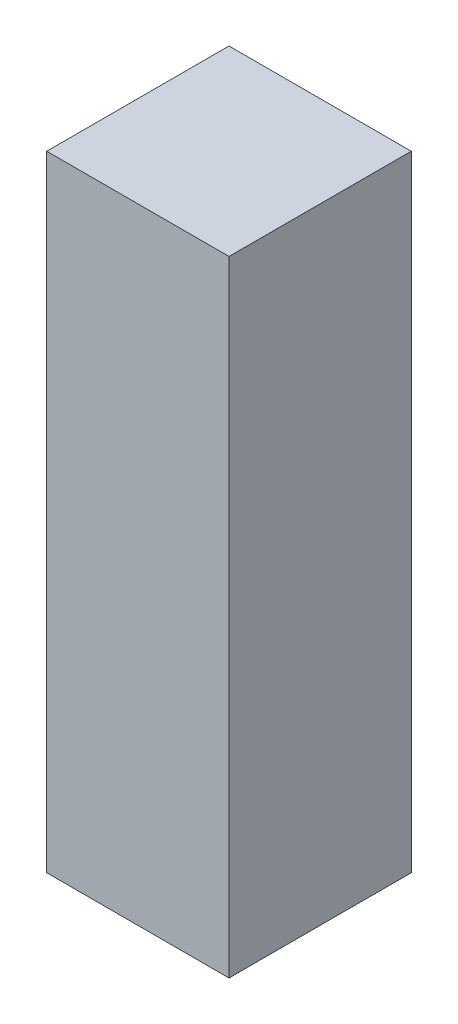
ISO-10303-21;
HEADER;
FILE_DESCRIPTION(('STEP AP214'),'2;1');
FILE_NAME('part.step','',(''),(''),'','','');
FILE_SCHEMA(('AUTOMOTIVE_DESIGN { 1 0 10303 214 1 1 1 1 }'));
ENDSEC;
DATA;
#1=APPLICATION_CONTEXT('core data for automotive mechanical design processes');
#2=APPLICATION_PROTOCOL_DEFINITION('international standard','automotive_design',2000,#1);
#3=PRODUCT_CONTEXT('',#1,'mechanical');
#4=PRODUCT('Part','Part','',(#3));
#5=PRODUCT_RELATED_PRODUCT_CATEGORY('part','',(#4));
#6=PRODUCT_DEFINITION_FORMATION('','',#4);
#7=PRODUCT_DEFINITION_CONTEXT('part definition',#1,'design');
#8=PRODUCT_DEFINITION('design','',#6,#7);
#9=PRODUCT_DEFINITION_SHAPE('','',#8);
#10=(LENGTH_UNIT() NAMED_UNIT(*) SI_UNIT(.MILLI.,.METRE.));
#11=(NAMED_UNIT(*) PLANE_ANGLE_UNIT() SI_UNIT($,.RADIAN.));
#12=(NAMED_UNIT(*) SI_UNIT($,.STERADIAN.) SOLID_ANGLE_UNIT());
#13=UNCERTAINTY_MEASURE_WITH_UNIT(LENGTH_MEASURE(1.E-05),#10,'distance_accuracy_value','');
#14=(GEOMETRIC_REPRESENTATION_CONTEXT(3) GLOBAL_UNCERTAINTY_ASSIGNED_CONTEXT((#13)) GLOBAL_UNIT_ASSIGNED_CONTEXT((#10,
#11,#12)) REPRESENTATION_CONTEXT('',''));
#15=CARTESIAN_POINT('',(0.,0.,0.));
#16=DIRECTION('',(0.,0.,1.));
#17=DIRECTION('',(1.,0.,0.));
#18=AXIS2_PLACEMENT_3D('',#15,#16,#17);
#19=CARTESIAN_POINT('',(44.45,304.8,44.45));
#20=DIRECTION('',(-1.,0.,0.));
#21=DIRECTION('',(0.,0.,1.));
#22=AXIS2_PLACEMENT_3D('',#19,#20,#21);
#23=PLANE('',#22);
#24=DIRECTION('',(0.,0.,-1.));
#25=VECTOR('',#24,1.);
#26=CARTESIAN_POINT('',(44.45,0.,44.45));
#27=LINE('',#26,#25);
#28=CARTESIAN_POINT('',(44.45,0.,44.45));
#29=VERTEX_POINT('',#28);
#30=CARTESIAN_POINT('',(44.45,0.,-44.45));
#31=VERTEX_POINT('',#30);
#32=EDGE_CURVE('E96',#29,#31,#27,.T.);
#33=ORIENTED_EDGE('',*,*,#32,.T.);
#34=DIRECTION('',(0.,-1.,0.));
#35=VECTOR('',#34,1.);
#36=CARTESIAN_POINT('',(44.45,304.8,-44.45));
#37=LINE('',#36,#35);
#38=CARTESIAN_POINT('',(44.45,304.8,-44.45));
#39=VERTEX_POINT('',#38);
#40=EDGE_CURVE('E11',#39,#31,#37,.T.);
#41=ORIENTED_EDGE('',*,*,#40,.F.);
#42=DIRECTION('',(0.,0.,-1.));
#43=VECTOR('',#42,1.);
#44=CARTESIAN_POINT('',(44.45,304.8,44.45));
#45=LINE('',#44,#43);
#46=CARTESIAN_POINT('',(44.45,304.8,44.45));
#47=VERTEX_POINT('',#46);
#48=EDGE_CURVE('E84',#47,#39,#45,.T.);
#49=ORIENTED_EDGE('',*,*,#48,.F.);
#50=DIRECTION('',(0.,-1.,0.));
#51=VECTOR('',#50,1.);
#52=CARTESIAN_POINT('',(44.45,304.8,44.45));
#53=LINE('',#52,#51);
#54=EDGE_CURVE('E92',#47,#29,#53,.T.);
#55=ORIENTED_EDGE('',*,*,#54,.T.);
#56=EDGE_LOOP('',(#33,#41,#49,#55));
#57=FACE_BOUND('',#56,.T.);
#58=ADVANCED_FACE('F33',(#57),#23,.F.);
#59=CARTESIAN_POINT('',(-44.45,304.8,-44.45));
#60=DIRECTION('',(0.,0.,1.));
#61=DIRECTION('',(1.,0.,0.));
#62=AXIS2_PLACEMENT_3D('',#59,#60,#61);
#63=PLANE('',#62);
#64=DIRECTION('',(-1.,0.,0.));
#65=VECTOR('',#64,1.);
#66=CARTESIAN_POINT('',(-44.45,0.,-44.45));
#67=LINE('',#66,#65);
#68=CARTESIAN_POINT('',(-44.45,0.,-44.45));
#69=VERTEX_POINT('',#68);
#70=EDGE_CURVE('E88',#31,#69,#67,.T.);
#71=ORIENTED_EDGE('',*,*,#70,.T.);
#72=DIRECTION('',(0.,-1.,0.));
#73=VECTOR('',#72,1.);
#74=CARTESIAN_POINT('',(-44.45,304.8,-44.45));
#75=LINE('',#74,#73);
#76=CARTESIAN_POINT('',(-44.45,304.8,-44.45));
#77=VERTEX_POINT('',#76);
#78=EDGE_CURVE('E41',#77,#69,#75,.T.);
#79=ORIENTED_EDGE('',*,*,#78,.F.);
#80=DIRECTION('',(-1.,0.,0.));
#81=VECTOR('',#80,1.);
#82=CARTESIAN_POINT('',(-44.45,304.8,-44.45));
#83=LINE('',#82,#81);
#84=EDGE_CURVE('E79',#39,#77,#83,.T.);
#85=ORIENTED_EDGE('',*,*,#84,.F.);
#86=ORIENTED_EDGE('',*,*,#40,.T.);
#87=EDGE_LOOP('',(#71,#79,#85,#86));
#88=FACE_BOUND('',#87,.T.);
#89=ADVANCED_FACE('F87',(#88),#63,.F.);
#90=CARTESIAN_POINT('',(-44.45,304.8,44.45));
#91=DIRECTION('',(1.,0.,0.));
#92=DIRECTION('',(0.,0.,-1.));
#93=AXIS2_PLACEMENT_3D('',#90,#91,#92);
#94=PLANE('',#93);
#95=DIRECTION('',(0.,0.,1.));
#96=VECTOR('',#95,1.);
#97=CARTESIAN_POINT('',(-44.45,0.,44.45));
#98=LINE('',#97,#96);
#99=CARTESIAN_POINT('',(-44.45,0.,44.45));
#100=VERTEX_POINT('',#99);
#101=EDGE_CURVE('E66',#69,#100,#98,.T.);
#102=ORIENTED_EDGE('',*,*,#101,.T.);
#103=DIRECTION('',(0.,-1.,0.));
#104=VECTOR('',#103,1.);
#105=CARTESIAN_POINT('',(-44.45,304.8,44.45));
#106=LINE('',#105,#104);
#107=CARTESIAN_POINT('',(-44.45,304.8,44.45));
#108=VERTEX_POINT('',#107);
#109=EDGE_CURVE('E89',#108,#100,#106,.T.);
#110=ORIENTED_EDGE('',*,*,#109,.F.);
#111=DIRECTION('',(0.,0.,1.));
#112=VECTOR('',#111,1.);
#113=CARTESIAN_POINT('',(-44.45,304.8,44.45));
#114=LINE('',#113,#112);
#115=EDGE_CURVE('E82',#77,#108,#114,.T.);
#116=ORIENTED_EDGE('',*,*,#115,.F.);
#117=ORIENTED_EDGE('',*,*,#78,.T.);
#118=EDGE_LOOP('',(#102,#110,#116,#117));
#119=FACE_BOUND('',#118,.T.);
#120=ADVANCED_FACE('F90',(#119),#94,.F.);
#121=CARTESIAN_POINT('',(-44.45,304.8,44.45));
#122=DIRECTION('',(0.,0.,-1.));
#123=DIRECTION('',(-1.,0.,0.));
#124=AXIS2_PLACEMENT_3D('',#121,#122,#123);
#125=PLANE('',#124);
#126=DIRECTION('',(1.,0.,0.));
#127=VECTOR('',#126,1.);
#128=CARTESIAN_POINT('',(-44.45,0.,44.45));
#129=LINE('',#128,#127);
#130=EDGE_CURVE('E72',#100,#29,#129,.T.);
#131=ORIENTED_EDGE('',*,*,#130,.T.);
#132=ORIENTED_EDGE('',*,*,#54,.F.);
#133=DIRECTION('',(1.,0.,0.));
#134=VECTOR('',#133,1.);
#135=CARTESIAN_POINT('',(-44.45,304.8,44.45));
#136=LINE('',#135,#134);
#137=EDGE_CURVE('E49',#108,#47,#136,.T.);
#138=ORIENTED_EDGE('',*,*,#137,.F.);
#139=ORIENTED_EDGE('',*,*,#109,.T.);
#140=EDGE_LOOP('',(#131,#132,#138,#139));
#141=FACE_BOUND('',#140,.T.);
#142=ADVANCED_FACE('F103',(#141),#125,.F.);
#143=CARTESIAN_POINT('',(0.,304.8,0.));
#144=DIRECTION('',(0.,-1.,0.));
#145=DIRECTION('',(0.,0.,-1.));
#146=AXIS2_PLACEMENT_3D('',#143,#144,#145);
#147=PLANE('',#146);
#148=ORIENTED_EDGE('',*,*,#48,.T.);
#149=ORIENTED_EDGE('',*,*,#84,.T.);
#150=ORIENTED_EDGE('',*,*,#115,.T.);
#151=ORIENTED_EDGE('',*,*,#137,.T.);
#152=EDGE_LOOP('',(#148,#149,#150,#151));
#153=FACE_BOUND('',#152,.T.);
#154=ADVANCED_FACE('F80',(#153),#147,.F.);
#155=CARTESIAN_POINT('',(0.,0.,0.));
#156=DIRECTION('',(0.,-1.,0.));
#157=DIRECTION('',(0.,0.,-1.));
#158=AXIS2_PLACEMENT_3D('',#155,#156,#157);
#159=PLANE('',#158);
#160=ORIENTED_EDGE('',*,*,#32,.F.);
#161=ORIENTED_EDGE('',*,*,#130,.F.);
#162=ORIENTED_EDGE('',*,*,#101,.F.);
#163=ORIENTED_EDGE('',*,*,#70,.F.);
#164=EDGE_LOOP('',(#160,#161,#162,#163));
#165=FACE_BOUND('',#164,.T.);
#166=ADVANCED_FACE('F106',(#165),#159,.T.);
#167=CLOSED_SHELL('',(#58,#89,#120,#142,#154,#166));
#168=MANIFOLD_SOLID_BREP('B2',#167);
#169=ADVANCED_BREP_SHAPE_REPRESENTATION('',(#18,#168),#14);
#170=SHAPE_DEFINITION_REPRESENTATION(#9,#169);
ENDSEC;
END-ISO-10303-21;
